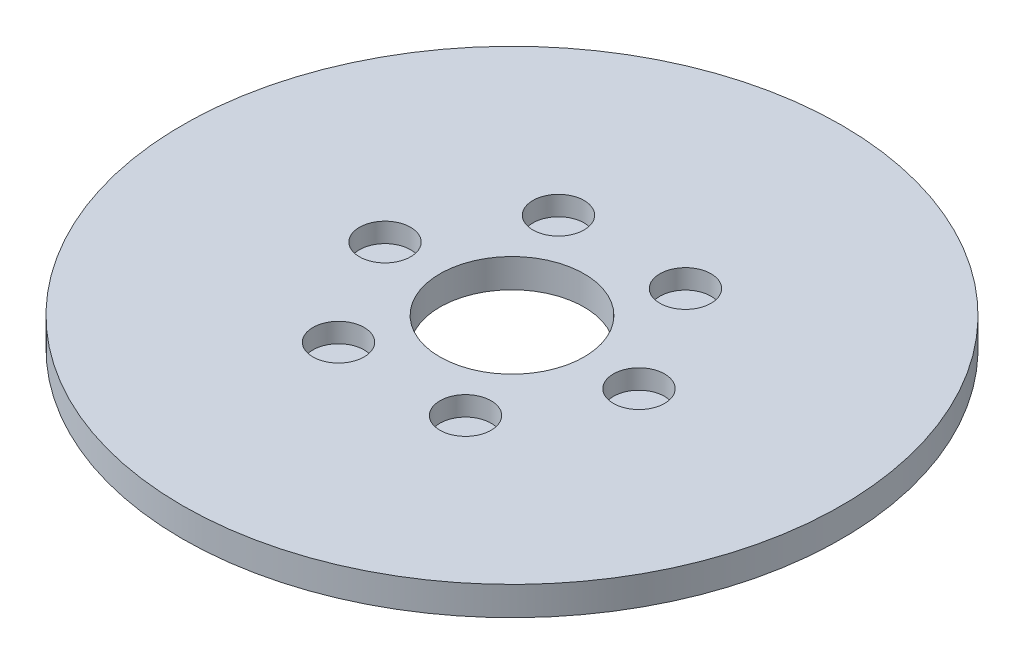
ISO-10303-21;
HEADER;
FILE_DESCRIPTION(('STEP AP214'),'2;1');
FILE_NAME('part.step','',(''),(''),'','','');
FILE_SCHEMA(('AUTOMOTIVE_DESIGN { 1 0 10303 214 1 1 1 1 }'));
ENDSEC;
DATA;
#1=APPLICATION_CONTEXT('core data for automotive mechanical design processes');
#2=APPLICATION_PROTOCOL_DEFINITION('international standard','automotive_design',2000,#1);
#3=PRODUCT_CONTEXT('',#1,'mechanical');
#4=PRODUCT('Part','Part','',(#3));
#5=PRODUCT_RELATED_PRODUCT_CATEGORY('part','',(#4));
#6=PRODUCT_DEFINITION_FORMATION('','',#4);
#7=PRODUCT_DEFINITION_CONTEXT('part definition',#1,'design');
#8=PRODUCT_DEFINITION('design','',#6,#7);
#9=PRODUCT_DEFINITION_SHAPE('','',#8);
#10=(LENGTH_UNIT() NAMED_UNIT(*) SI_UNIT(.MILLI.,.METRE.));
#11=(NAMED_UNIT(*) PLANE_ANGLE_UNIT() SI_UNIT($,.RADIAN.));
#12=(NAMED_UNIT(*) SI_UNIT($,.STERADIAN.) SOLID_ANGLE_UNIT());
#13=UNCERTAINTY_MEASURE_WITH_UNIT(LENGTH_MEASURE(1.E-05),#10,'distance_accuracy_value','');
#14=(GEOMETRIC_REPRESENTATION_CONTEXT(3) GLOBAL_UNCERTAINTY_ASSIGNED_CONTEXT((#13)) GLOBAL_UNIT_ASSIGNED_CONTEXT((#10,
#11,#12)) REPRESENTATION_CONTEXT('',''));
#15=CARTESIAN_POINT('',(0.,0.,0.));
#16=DIRECTION('',(0.,0.,1.));
#17=DIRECTION('',(1.,0.,0.));
#18=AXIS2_PLACEMENT_3D('',#15,#16,#17);
#19=CARTESIAN_POINT('',(0.,7.,0.));
#20=DIRECTION('',(0.,-1.,0.));
#21=DIRECTION('',(0.,0.,-1.));
#22=AXIS2_PLACEMENT_3D('',#19,#20,#21);
#23=CYLINDRICAL_SURFACE('',#22,80.);
#24=CARTESIAN_POINT('',(0.,7.,0.));
#25=DIRECTION('',(0.,1.,0.));
#26=DIRECTION('',(0.,0.,1.));
#27=AXIS2_PLACEMENT_3D('',#24,#25,#26);
#28=CIRCLE('',#27,80.);
#29=CARTESIAN_POINT('',(0.,7.,80.));
#30=VERTEX_POINT('',#29);
#31=EDGE_CURVE('E10',#30,#30,#28,.T.);
#32=ORIENTED_EDGE('',*,*,#31,.F.);
#33=EDGE_LOOP('',(#32));
#34=FACE_BOUND('',#33,.T.);
#35=CARTESIAN_POINT('',(0.,0.,0.));
#36=DIRECTION('',(0.,1.,0.));
#37=DIRECTION('',(0.,0.,1.));
#38=AXIS2_PLACEMENT_3D('',#35,#36,#37);
#39=CIRCLE('',#38,80.);
#40=CARTESIAN_POINT('',(0.,0.,80.));
#41=VERTEX_POINT('',#40);
#42=EDGE_CURVE('E37',#41,#41,#39,.T.);
#43=ORIENTED_EDGE('',*,*,#42,.T.);
#44=EDGE_LOOP('',(#43));
#45=FACE_BOUND('',#44,.T.);
#46=ADVANCED_FACE('F40',(#34,#45),#23,.T.);
#47=CARTESIAN_POINT('',(0.,7.,0.));
#48=DIRECTION('',(0.,1.,0.));
#49=DIRECTION('',(0.,0.,1.));
#50=AXIS2_PLACEMENT_3D('',#47,#48,#49);
#51=PLANE('',#50);
#52=CARTESIAN_POINT('',(-15.4122662019999,7.,-26.6948281216396));
#53=DIRECTION('',(0.,1.,0.));
#54=DIRECTION('',(-0.866025403784433,0.,0.50000000000001));
#55=AXIS2_PLACEMENT_3D('',#52,#53,#54);
#56=CIRCLE('',#55,6.21368784421309);
#57=CARTESIAN_POINT('',(-20.7934777262749,7.,-23.587984199533));
#58=VERTEX_POINT('',#57);
#59=EDGE_CURVE('E70',#58,#58,#56,.T.);
#60=ORIENTED_EDGE('',*,*,#59,.F.);
#61=EDGE_LOOP('',(#60));
#62=FACE_BOUND('',#61,.T.);
#63=CARTESIAN_POINT('',(15.4122662019993,7.,-26.69482812164));
#64=DIRECTION('',(0.,1.,0.));
#65=DIRECTION('',(-0.866025403784443,0.,-0.499999999999992));
#66=AXIS2_PLACEMENT_3D('',#63,#64,#65);
#67=CIRCLE('',#66,6.21368784421309);
#68=CARTESIAN_POINT('',(10.0310546777242,7.,-29.8016720437465));
#69=VERTEX_POINT('',#68);
#70=EDGE_CURVE('E71',#69,#69,#67,.T.);
#71=ORIENTED_EDGE('',*,*,#70,.F.);
#72=EDGE_LOOP('',(#71));
#73=FACE_BOUND('',#72,.T.);
#74=CARTESIAN_POINT('',(30.8245324039991,7.,0.));
#75=DIRECTION('',(0.,1.,0.));
#76=DIRECTION('',(0.,0.,-1.));
#77=AXIS2_PLACEMENT_3D('',#74,#75,#76);
#78=CIRCLE('',#77,6.21368784421309);
#79=CARTESIAN_POINT('',(30.8245324039991,7.,-6.21368784421309));
#80=VERTEX_POINT('',#79);
#81=EDGE_CURVE('E78',#80,#80,#78,.T.);
#82=ORIENTED_EDGE('',*,*,#81,.F.);
#83=EDGE_LOOP('',(#82));
#84=FACE_BOUND('',#83,.T.);
#85=CARTESIAN_POINT('',(15.4122662019997,7.,26.6948281216398));
#86=DIRECTION('',(0.,1.,0.));
#87=DIRECTION('',(0.866025403784436,0.,-0.500000000000004));
#88=AXIS2_PLACEMENT_3D('',#85,#86,#87);
#89=CIRCLE('',#88,6.21368784421309);
#90=CARTESIAN_POINT('',(20.7934777262747,7.,23.5879841995332));
#91=VERTEX_POINT('',#90);
#92=EDGE_CURVE('E84',#91,#91,#89,.T.);
#93=ORIENTED_EDGE('',*,*,#92,.F.);
#94=EDGE_LOOP('',(#93));
#95=FACE_BOUND('',#94,.T.);
#96=CARTESIAN_POINT('',(-15.4122662019995,7.,26.6948281216399));
#97=DIRECTION('',(0.,1.,0.));
#98=DIRECTION('',(0.86602540378444,0.,0.499999999999998));
#99=AXIS2_PLACEMENT_3D('',#96,#97,#98);
#100=CIRCLE('',#99,6.21368784421309);
#101=CARTESIAN_POINT('',(-10.0310546777244,7.,29.8016720437464));
#102=VERTEX_POINT('',#101);
#103=EDGE_CURVE('E61',#102,#102,#100,.T.);
#104=ORIENTED_EDGE('',*,*,#103,.F.);
#105=EDGE_LOOP('',(#104));
#106=FACE_BOUND('',#105,.T.);
#107=CARTESIAN_POINT('',(-30.8245324039991,7.,0.));
#108=DIRECTION('',(0.,1.,0.));
#109=DIRECTION('',(0.,0.,1.));
#110=AXIS2_PLACEMENT_3D('',#107,#108,#109);
#111=CIRCLE('',#110,6.21368784421309);
#112=CARTESIAN_POINT('',(-30.8245324039991,7.,6.21368784421309));
#113=VERTEX_POINT('',#112);
#114=EDGE_CURVE('E54',#113,#113,#111,.T.);
#115=ORIENTED_EDGE('',*,*,#114,.F.);
#116=EDGE_LOOP('',(#115));
#117=FACE_BOUND('',#116,.T.);
#118=CARTESIAN_POINT('',(0.,7.,0.));
#119=DIRECTION('',(0.,1.,0.));
#120=DIRECTION('',(0.,0.,1.));
#121=AXIS2_PLACEMENT_3D('',#118,#119,#120);
#122=CIRCLE('',#121,17.5);
#123=CARTESIAN_POINT('',(0.,7.,17.5));
#124=VERTEX_POINT('',#123);
#125=EDGE_CURVE('E50',#124,#124,#122,.T.);
#126=ORIENTED_EDGE('',*,*,#125,.F.);
#127=EDGE_LOOP('',(#126));
#128=FACE_BOUND('',#127,.T.);
#129=ORIENTED_EDGE('',*,*,#31,.T.);
#130=EDGE_LOOP('',(#129));
#131=FACE_BOUND('',#130,.T.);
#132=ADVANCED_FACE('F99',(#62,#73,#84,#95,#106,#117,#128,#131),#51,.T.);
#133=CARTESIAN_POINT('',(0.,0.,0.));
#134=DIRECTION('',(0.,1.,0.));
#135=DIRECTION('',(0.,0.,1.));
#136=AXIS2_PLACEMENT_3D('',#133,#134,#135);
#137=PLANE('',#136);
#138=CARTESIAN_POINT('',(0.,0.,0.));
#139=DIRECTION('',(0.,1.,0.));
#140=DIRECTION('',(0.,0.,1.));
#141=AXIS2_PLACEMENT_3D('',#138,#139,#140);
#142=CIRCLE('',#141,17.5);
#143=CARTESIAN_POINT('',(0.,0.,17.5));
#144=VERTEX_POINT('',#143);
#145=EDGE_CURVE('E47',#144,#144,#142,.T.);
#146=ORIENTED_EDGE('',*,*,#145,.T.);
#147=EDGE_LOOP('',(#146));
#148=FACE_BOUND('',#147,.T.);
#149=ORIENTED_EDGE('',*,*,#42,.F.);
#150=EDGE_LOOP('',(#149));
#151=FACE_BOUND('',#150,.T.);
#152=ADVANCED_FACE('F103',(#148,#151),#137,.F.);
#153=CARTESIAN_POINT('',(0.,7.,0.));
#154=DIRECTION('',(0.,-1.,0.));
#155=DIRECTION('',(0.,0.,-1.));
#156=AXIS2_PLACEMENT_3D('',#153,#154,#155);
#157=CYLINDRICAL_SURFACE('',#156,17.5);
#158=ORIENTED_EDGE('',*,*,#125,.T.);
#159=EDGE_LOOP('',(#158));
#160=FACE_BOUND('',#159,.T.);
#161=ORIENTED_EDGE('',*,*,#145,.F.);
#162=EDGE_LOOP('',(#161));
#163=FACE_BOUND('',#162,.T.);
#164=ADVANCED_FACE('F115',(#160,#163),#157,.F.);
#165=CARTESIAN_POINT('',(-30.8245324039991,2.27308904737129,0.));
#166=DIRECTION('',(0.,1.,0.));
#167=DIRECTION('',(0.,0.,1.));
#168=AXIS2_PLACEMENT_3D('',#165,#166,#167);
#169=CYLINDRICAL_SURFACE('',#168,6.21368784421309);
#170=CARTESIAN_POINT('',(-30.8245324039991,2.27308904737129,0.));
#171=DIRECTION('',(0.,1.,0.));
#172=DIRECTION('',(0.,0.,1.));
#173=AXIS2_PLACEMENT_3D('',#170,#171,#172);
#174=CIRCLE('',#173,6.21368784421309);
#175=CARTESIAN_POINT('',(-30.8245324039991,2.27308904737129,6.21368784421309));
#176=VERTEX_POINT('',#175);
#177=EDGE_CURVE('E55',#176,#176,#174,.T.);
#178=ORIENTED_EDGE('',*,*,#177,.F.);
#179=EDGE_LOOP('',(#178));
#180=FACE_BOUND('',#179,.T.);
#181=ORIENTED_EDGE('',*,*,#114,.T.);
#182=EDGE_LOOP('',(#181));
#183=FACE_BOUND('',#182,.T.);
#184=ADVANCED_FACE('F113',(#180,#183),#169,.F.);
#185=CARTESIAN_POINT('',(-30.8245324039991,2.27308904737129,0.));
#186=DIRECTION('',(0.,1.,0.));
#187=DIRECTION('',(0.,0.,1.));
#188=AXIS2_PLACEMENT_3D('',#185,#186,#187);
#189=PLANE('',#188);
#190=ORIENTED_EDGE('',*,*,#177,.T.);
#191=EDGE_LOOP('',(#190));
#192=FACE_BOUND('',#191,.T.);
#193=ADVANCED_FACE('F144',(#192),#189,.T.);
#194=CARTESIAN_POINT('',(-15.4122662019995,2.27308904737129,26.6948281216399));
#195=DIRECTION('',(0.,1.,0.));
#196=DIRECTION('',(0.,0.,1.));
#197=AXIS2_PLACEMENT_3D('',#194,#195,#196);
#198=CYLINDRICAL_SURFACE('',#197,6.21368784421309);
#199=CARTESIAN_POINT('',(-15.4122662019995,2.27308904737129,26.6948281216399));
#200=DIRECTION('',(0.,1.,0.));
#201=DIRECTION('',(0.86602540378444,0.,0.499999999999998));
#202=AXIS2_PLACEMENT_3D('',#199,#200,#201);
#203=CIRCLE('',#202,6.21368784421309);
#204=CARTESIAN_POINT('',(-10.0310546777244,2.27308904737129,29.8016720437464));
#205=VERTEX_POINT('',#204);
#206=EDGE_CURVE('E59',#205,#205,#203,.T.);
#207=ORIENTED_EDGE('',*,*,#206,.F.);
#208=EDGE_LOOP('',(#207));
#209=FACE_BOUND('',#208,.T.);
#210=ORIENTED_EDGE('',*,*,#103,.T.);
#211=EDGE_LOOP('',(#210));
#212=FACE_BOUND('',#211,.T.);
#213=ADVANCED_FACE('F153',(#209,#212),#198,.F.);
#214=CARTESIAN_POINT('',(-15.4122662019995,2.27308904737129,26.6948281216399));
#215=DIRECTION('',(0.,1.,0.));
#216=DIRECTION('',(0.86602540378444,0.,0.499999999999998));
#217=AXIS2_PLACEMENT_3D('',#214,#215,#216);
#218=PLANE('',#217);
#219=ORIENTED_EDGE('',*,*,#206,.T.);
#220=EDGE_LOOP('',(#219));
#221=FACE_BOUND('',#220,.T.);
#222=ADVANCED_FACE('F96',(#221),#218,.T.);
#223=CARTESIAN_POINT('',(15.4122662019997,2.27308904737129,26.6948281216398));
#224=DIRECTION('',(0.,1.,0.));
#225=DIRECTION('',(0.,0.,1.));
#226=AXIS2_PLACEMENT_3D('',#223,#224,#225);
#227=CYLINDRICAL_SURFACE('',#226,6.21368784421309);
#228=CARTESIAN_POINT('',(15.4122662019997,2.27308904737129,26.6948281216398));
#229=DIRECTION('',(0.,1.,0.));
#230=DIRECTION('',(0.866025403784436,0.,-0.500000000000004));
#231=AXIS2_PLACEMENT_3D('',#228,#229,#230);
#232=CIRCLE('',#231,6.21368784421309);
#233=CARTESIAN_POINT('',(20.7934777262747,2.27308904737129,23.5879841995332));
#234=VERTEX_POINT('',#233);
#235=EDGE_CURVE('E63',#234,#234,#232,.T.);
#236=ORIENTED_EDGE('',*,*,#235,.F.);
#237=EDGE_LOOP('',(#236));
#238=FACE_BOUND('',#237,.T.);
#239=ORIENTED_EDGE('',*,*,#92,.T.);
#240=EDGE_LOOP('',(#239));
#241=FACE_BOUND('',#240,.T.);
#242=ADVANCED_FACE('F91',(#238,#241),#227,.F.);
#243=CARTESIAN_POINT('',(15.4122662019997,2.27308904737129,26.6948281216398));
#244=DIRECTION('',(0.,1.,0.));
#245=DIRECTION('',(0.866025403784436,0.,-0.500000000000004));
#246=AXIS2_PLACEMENT_3D('',#243,#244,#245);
#247=PLANE('',#246);
#248=ORIENTED_EDGE('',*,*,#235,.T.);
#249=EDGE_LOOP('',(#248));
#250=FACE_BOUND('',#249,.T.);
#251=ADVANCED_FACE('F93',(#250),#247,.T.);
#252=CARTESIAN_POINT('',(30.8245324039991,2.27308904737129,0.));
#253=DIRECTION('',(0.,1.,0.));
#254=DIRECTION('',(0.,0.,1.));
#255=AXIS2_PLACEMENT_3D('',#252,#253,#254);
#256=CYLINDRICAL_SURFACE('',#255,6.21368784421309);
#257=CARTESIAN_POINT('',(30.8245324039991,2.27308904737129,0.));
#258=DIRECTION('',(0.,1.,0.));
#259=DIRECTION('',(0.,0.,-1.));
#260=AXIS2_PLACEMENT_3D('',#257,#258,#259);
#261=CIRCLE('',#260,6.21368784421309);
#262=CARTESIAN_POINT('',(30.8245324039991,2.27308904737129,-6.21368784421309));
#263=VERTEX_POINT('',#262);
#264=EDGE_CURVE('E85',#263,#263,#261,.T.);
#265=ORIENTED_EDGE('',*,*,#264,.F.);
#266=EDGE_LOOP('',(#265));
#267=FACE_BOUND('',#266,.T.);
#268=ORIENTED_EDGE('',*,*,#81,.T.);
#269=EDGE_LOOP('',(#268));
#270=FACE_BOUND('',#269,.T.);
#271=ADVANCED_FACE('F187',(#267,#270),#256,.F.);
#272=CARTESIAN_POINT('',(30.8245324039991,2.27308904737129,0.));
#273=DIRECTION('',(0.,1.,0.));
#274=DIRECTION('',(0.,0.,-1.));
#275=AXIS2_PLACEMENT_3D('',#272,#273,#274);
#276=PLANE('',#275);
#277=ORIENTED_EDGE('',*,*,#264,.T.);
#278=EDGE_LOOP('',(#277));
#279=FACE_BOUND('',#278,.T.);
#280=ADVANCED_FACE('F198',(#279),#276,.T.);
#281=CARTESIAN_POINT('',(15.4122662019993,2.27308904737129,-26.69482812164));
#282=DIRECTION('',(0.,1.,0.));
#283=DIRECTION('',(0.,0.,1.));
#284=AXIS2_PLACEMENT_3D('',#281,#282,#283);
#285=CYLINDRICAL_SURFACE('',#284,6.21368784421309);
#286=CARTESIAN_POINT('',(15.4122662019993,2.27308904737129,-26.69482812164));
#287=DIRECTION('',(0.,1.,0.));
#288=DIRECTION('',(-0.866025403784443,0.,-0.499999999999992));
#289=AXIS2_PLACEMENT_3D('',#286,#287,#288);
#290=CIRCLE('',#289,6.21368784421309);
#291=CARTESIAN_POINT('',(10.0310546777242,2.27308904737129,-29.8016720437465));
#292=VERTEX_POINT('',#291);
#293=EDGE_CURVE('E76',#292,#292,#290,.T.);
#294=ORIENTED_EDGE('',*,*,#293,.F.);
#295=EDGE_LOOP('',(#294));
#296=FACE_BOUND('',#295,.T.);
#297=ORIENTED_EDGE('',*,*,#70,.T.);
#298=EDGE_LOOP('',(#297));
#299=FACE_BOUND('',#298,.T.);
#300=ADVANCED_FACE('F202',(#296,#299),#285,.F.);
#301=CARTESIAN_POINT('',(15.4122662019993,2.27308904737129,-26.69482812164));
#302=DIRECTION('',(0.,1.,0.));
#303=DIRECTION('',(-0.866025403784443,0.,-0.499999999999992));
#304=AXIS2_PLACEMENT_3D('',#301,#302,#303);
#305=PLANE('',#304);
#306=ORIENTED_EDGE('',*,*,#293,.T.);
#307=EDGE_LOOP('',(#306));
#308=FACE_BOUND('',#307,.T.);
#309=ADVANCED_FACE('F212',(#308),#305,.T.);
#310=CARTESIAN_POINT('',(-15.4122662019999,2.27308904737129,-26.6948281216396));
#311=DIRECTION('',(0.,1.,0.));
#312=DIRECTION('',(0.,0.,1.));
#313=AXIS2_PLACEMENT_3D('',#310,#311,#312);
#314=CYLINDRICAL_SURFACE('',#313,6.21368784421309);
#315=CARTESIAN_POINT('',(-15.4122662019999,2.27308904737129,-26.6948281216396));
#316=DIRECTION('',(0.,1.,0.));
#317=DIRECTION('',(-0.866025403784433,0.,0.50000000000001));
#318=AXIS2_PLACEMENT_3D('',#315,#316,#317);
#319=CIRCLE('',#318,6.21368784421309);
#320=CARTESIAN_POINT('',(-20.7934777262749,2.27308904737129,-23.587984199533));
#321=VERTEX_POINT('',#320);
#322=EDGE_CURVE('E69',#321,#321,#319,.T.);
#323=ORIENTED_EDGE('',*,*,#322,.F.);
#324=EDGE_LOOP('',(#323));
#325=FACE_BOUND('',#324,.T.);
#326=ORIENTED_EDGE('',*,*,#59,.T.);
#327=EDGE_LOOP('',(#326));
#328=FACE_BOUND('',#327,.T.);
#329=ADVANCED_FACE('F224',(#325,#328),#314,.F.);
#330=CARTESIAN_POINT('',(-15.4122662019999,2.27308904737129,-26.6948281216396));
#331=DIRECTION('',(0.,1.,0.));
#332=DIRECTION('',(-0.866025403784433,0.,0.50000000000001));
#333=AXIS2_PLACEMENT_3D('',#330,#331,#332);
#334=PLANE('',#333);
#335=ORIENTED_EDGE('',*,*,#322,.T.);
#336=EDGE_LOOP('',(#335));
#337=FACE_BOUND('',#336,.T.);
#338=ADVANCED_FACE('F235',(#337),#334,.T.);
#339=CLOSED_SHELL('',(#46,#132,#152,#164,#184,#193,#213,#222,#242,#251,#271,#280,#300,#309,#329,#338));
#340=MANIFOLD_SOLID_BREP('B2',#339);
#341=ADVANCED_BREP_SHAPE_REPRESENTATION('',(#18,#340),#14);
#342=SHAPE_DEFINITION_REPRESENTATION(#9,#341);
ENDSEC;
END-ISO-10303-21;
